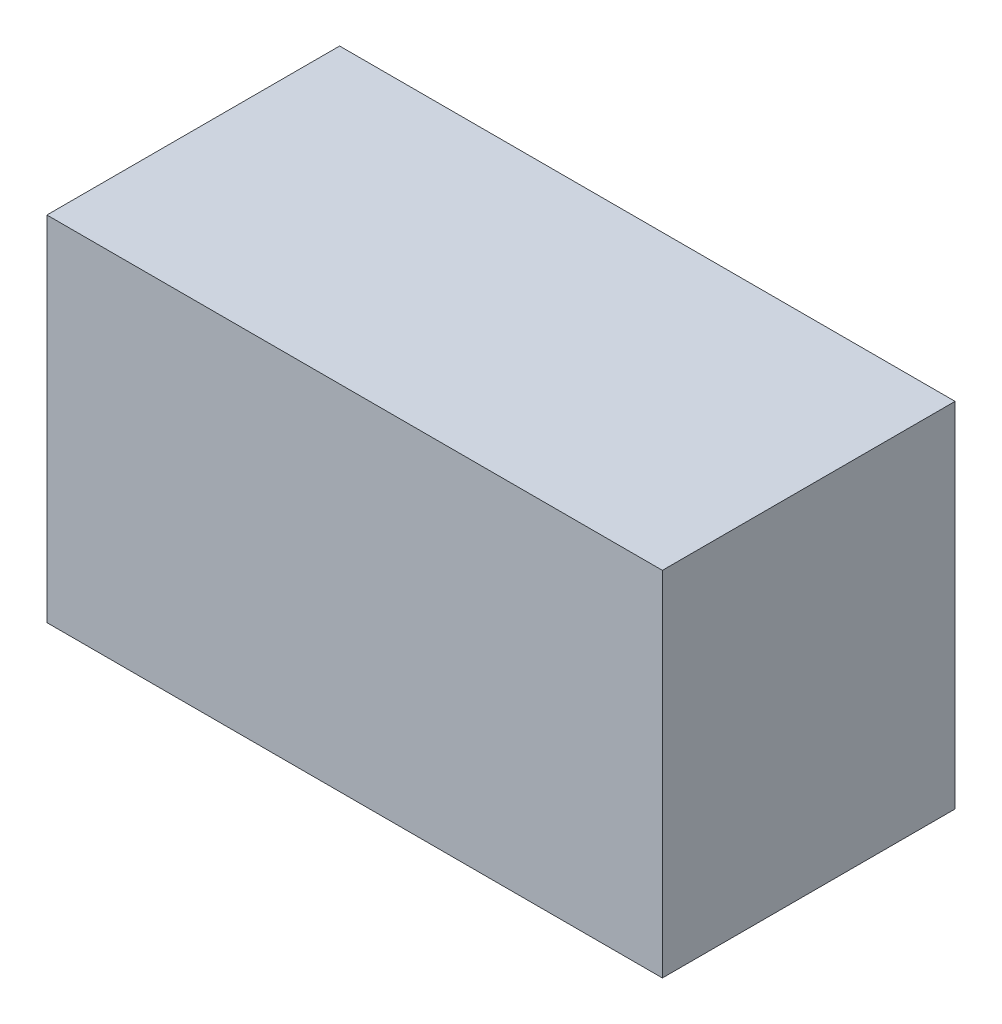
ISO-10303-21;
HEADER;
FILE_DESCRIPTION(('STEP AP214'),'2;1');
FILE_NAME('part.step','',(''),(''),'','','');
FILE_SCHEMA(('AUTOMOTIVE_DESIGN { 1 0 10303 214 1 1 1 1 }'));
ENDSEC;
DATA;
#1=APPLICATION_CONTEXT('core data for automotive mechanical design processes');
#2=APPLICATION_PROTOCOL_DEFINITION('international standard','automotive_design',2000,#1);
#3=PRODUCT_CONTEXT('',#1,'mechanical');
#4=PRODUCT('Part','Part','',(#3));
#5=PRODUCT_RELATED_PRODUCT_CATEGORY('part','',(#4));
#6=PRODUCT_DEFINITION_FORMATION('','',#4);
#7=PRODUCT_DEFINITION_CONTEXT('part definition',#1,'design');
#8=PRODUCT_DEFINITION('design','',#6,#7);
#9=PRODUCT_DEFINITION_SHAPE('','',#8);
#10=(LENGTH_UNIT() NAMED_UNIT(*) SI_UNIT(.MILLI.,.METRE.));
#11=(NAMED_UNIT(*) PLANE_ANGLE_UNIT() SI_UNIT($,.RADIAN.));
#12=(NAMED_UNIT(*) SI_UNIT($,.STERADIAN.) SOLID_ANGLE_UNIT());
#13=UNCERTAINTY_MEASURE_WITH_UNIT(LENGTH_MEASURE(1.E-05),#10,'distance_accuracy_value','');
#14=(GEOMETRIC_REPRESENTATION_CONTEXT(3) GLOBAL_UNCERTAINTY_ASSIGNED_CONTEXT((#13)) GLOBAL_UNIT_ASSIGNED_CONTEXT((#10,
#11,#12)) REPRESENTATION_CONTEXT('',''));
#15=CARTESIAN_POINT('',(0.,0.,0.));
#16=DIRECTION('',(0.,0.,1.));
#17=DIRECTION('',(1.,0.,0.));
#18=AXIS2_PLACEMENT_3D('',#15,#16,#17);
#19=CARTESIAN_POINT('',(-1.52449276,-0.87449152,1.44999964));
#20=DIRECTION('',(0.,0.,1.));
#21=DIRECTION('',(1.,0.,0.));
#22=AXIS2_PLACEMENT_3D('',#19,#20,#21);
#23=PLANE('',#22);
#24=DIRECTION('',(-1.,0.,0.));
#25=VECTOR('',#24,1.);
#26=CARTESIAN_POINT('',(1.52449276,-0.87449152,1.44999964));
#27=LINE('',#26,#25);
#28=CARTESIAN_POINT('',(1.52449276,-0.87449152,1.44999964));
#29=VERTEX_POINT('',#28);
#30=CARTESIAN_POINT('',(-1.52449276,-0.87449152,1.44999964));
#31=VERTEX_POINT('',#30);
#32=EDGE_CURVE('E25',#29,#31,#27,.T.);
#33=ORIENTED_EDGE('',*,*,#32,.F.);
#34=DIRECTION('',(0.,-1.,0.));
#35=VECTOR('',#34,1.);
#36=CARTESIAN_POINT('',(1.52449276,0.87449152,1.44999964));
#37=LINE('',#36,#35);
#38=CARTESIAN_POINT('',(1.52449276,0.87449152,1.44999964));
#39=VERTEX_POINT('',#38);
#40=EDGE_CURVE('E94',#39,#29,#37,.T.);
#41=ORIENTED_EDGE('',*,*,#40,.F.);
#42=DIRECTION('',(1.,0.,0.));
#43=VECTOR('',#42,1.);
#44=CARTESIAN_POINT('',(-1.52449276,0.87449152,1.44999964));
#45=LINE('',#44,#43);
#46=CARTESIAN_POINT('',(-1.52449276,0.87449152,1.44999964));
#47=VERTEX_POINT('',#46);
#48=EDGE_CURVE('E82',#47,#39,#45,.T.);
#49=ORIENTED_EDGE('',*,*,#48,.F.);
#50=DIRECTION('',(0.,1.,0.));
#51=VECTOR('',#50,1.);
#52=CARTESIAN_POINT('',(-1.52449276,-0.87449152,1.44999964));
#53=LINE('',#52,#51);
#54=EDGE_CURVE('E86',#31,#47,#53,.T.);
#55=ORIENTED_EDGE('',*,*,#54,.F.);
#56=EDGE_LOOP('',(#33,#41,#49,#55));
#57=FACE_BOUND('',#56,.T.);
#58=ADVANCED_FACE('F17',(#57),#23,.T.);
#59=CARTESIAN_POINT('',(-1.52449276,-0.87449152,0.));
#60=DIRECTION('',(0.,0.,1.));
#61=DIRECTION('',(1.,0.,0.));
#62=AXIS2_PLACEMENT_3D('',#59,#60,#61);
#63=PLANE('',#62);
#64=DIRECTION('',(0.,1.,0.));
#65=VECTOR('',#64,1.);
#66=CARTESIAN_POINT('',(-1.52449276,-0.87449152,0.));
#67=LINE('',#66,#65);
#68=CARTESIAN_POINT('',(-1.52449276,-0.87449152,0.));
#69=VERTEX_POINT('',#68);
#70=CARTESIAN_POINT('',(-1.52449276,0.87449152,0.));
#71=VERTEX_POINT('',#70);
#72=EDGE_CURVE('E70',#69,#71,#67,.T.);
#73=ORIENTED_EDGE('',*,*,#72,.T.);
#74=DIRECTION('',(1.,0.,0.));
#75=VECTOR('',#74,1.);
#76=CARTESIAN_POINT('',(-1.52449276,0.87449152,0.));
#77=LINE('',#76,#75);
#78=CARTESIAN_POINT('',(1.52449276,0.87449152,0.));
#79=VERTEX_POINT('',#78);
#80=EDGE_CURVE('E105',#71,#79,#77,.T.);
#81=ORIENTED_EDGE('',*,*,#80,.T.);
#82=DIRECTION('',(0.,-1.,0.));
#83=VECTOR('',#82,1.);
#84=CARTESIAN_POINT('',(1.52449276,0.87449152,0.));
#85=LINE('',#84,#83);
#86=CARTESIAN_POINT('',(1.52449276,-0.87449152,0.));
#87=VERTEX_POINT('',#86);
#88=EDGE_CURVE('E72',#79,#87,#85,.T.);
#89=ORIENTED_EDGE('',*,*,#88,.T.);
#90=DIRECTION('',(-1.,0.,0.));
#91=VECTOR('',#90,1.);
#92=CARTESIAN_POINT('',(1.52449276,-0.87449152,0.));
#93=LINE('',#92,#91);
#94=EDGE_CURVE('E11',#87,#69,#93,.T.);
#95=ORIENTED_EDGE('',*,*,#94,.T.);
#96=EDGE_LOOP('',(#73,#81,#89,#95));
#97=FACE_BOUND('',#96,.T.);
#98=ADVANCED_FACE('F68',(#97),#63,.F.);
#99=CARTESIAN_POINT('',(1.52449276,-0.87449152,0.));
#100=DIRECTION('',(0.,-1.,0.));
#101=DIRECTION('',(0.,0.,-1.));
#102=AXIS2_PLACEMENT_3D('',#99,#100,#101);
#103=PLANE('',#102);
#104=DIRECTION('',(0.,0.,1.));
#105=VECTOR('',#104,1.);
#106=CARTESIAN_POINT('',(1.52449276,-0.87449152,0.));
#107=LINE('',#106,#105);
#108=EDGE_CURVE('E110',#87,#29,#107,.T.);
#109=ORIENTED_EDGE('',*,*,#108,.T.);
#110=ORIENTED_EDGE('',*,*,#32,.T.);
#111=DIRECTION('',(0.,0.,1.));
#112=VECTOR('',#111,1.);
#113=CARTESIAN_POINT('',(-1.52449276,-0.87449152,0.));
#114=LINE('',#113,#112);
#115=EDGE_CURVE('E78',#69,#31,#114,.T.);
#116=ORIENTED_EDGE('',*,*,#115,.F.);
#117=ORIENTED_EDGE('',*,*,#94,.F.);
#118=EDGE_LOOP('',(#109,#110,#116,#117));
#119=FACE_BOUND('',#118,.T.);
#120=ADVANCED_FACE('F84',(#119),#103,.T.);
#121=CARTESIAN_POINT('',(1.52449276,0.87449152,0.));
#122=DIRECTION('',(1.,0.,0.));
#123=DIRECTION('',(0.,1.,0.));
#124=AXIS2_PLACEMENT_3D('',#121,#122,#123);
#125=PLANE('',#124);
#126=DIRECTION('',(0.,0.,1.));
#127=VECTOR('',#126,1.);
#128=CARTESIAN_POINT('',(1.52449276,0.87449152,0.));
#129=LINE('',#128,#127);
#130=EDGE_CURVE('E99',#79,#39,#129,.T.);
#131=ORIENTED_EDGE('',*,*,#130,.T.);
#132=ORIENTED_EDGE('',*,*,#40,.T.);
#133=ORIENTED_EDGE('',*,*,#108,.F.);
#134=ORIENTED_EDGE('',*,*,#88,.F.);
#135=EDGE_LOOP('',(#131,#132,#133,#134));
#136=FACE_BOUND('',#135,.T.);
#137=ADVANCED_FACE('F153',(#136),#125,.T.);
#138=CARTESIAN_POINT('',(-1.52449276,0.87449152,0.));
#139=DIRECTION('',(0.,1.,0.));
#140=DIRECTION('',(1.,0.,0.));
#141=AXIS2_PLACEMENT_3D('',#138,#139,#140);
#142=PLANE('',#141);
#143=DIRECTION('',(0.,0.,1.));
#144=VECTOR('',#143,1.);
#145=CARTESIAN_POINT('',(-1.52449276,0.87449152,0.));
#146=LINE('',#145,#144);
#147=EDGE_CURVE('E80',#71,#47,#146,.T.);
#148=ORIENTED_EDGE('',*,*,#147,.T.);
#149=ORIENTED_EDGE('',*,*,#48,.T.);
#150=ORIENTED_EDGE('',*,*,#130,.F.);
#151=ORIENTED_EDGE('',*,*,#80,.F.);
#152=EDGE_LOOP('',(#148,#149,#150,#151));
#153=FACE_BOUND('',#152,.T.);
#154=ADVANCED_FACE('F156',(#153),#142,.T.);
#155=CARTESIAN_POINT('',(-1.52449276,-0.87449152,0.));
#156=DIRECTION('',(-1.,0.,0.));
#157=DIRECTION('',(0.,0.,1.));
#158=AXIS2_PLACEMENT_3D('',#155,#156,#157);
#159=PLANE('',#158);
#160=ORIENTED_EDGE('',*,*,#115,.T.);
#161=ORIENTED_EDGE('',*,*,#54,.T.);
#162=ORIENTED_EDGE('',*,*,#147,.F.);
#163=ORIENTED_EDGE('',*,*,#72,.F.);
#164=EDGE_LOOP('',(#160,#161,#162,#163));
#165=FACE_BOUND('',#164,.T.);
#166=ADVANCED_FACE('F76',(#165),#159,.T.);
#167=CLOSED_SHELL('',(#58,#98,#120,#137,#154,#166));
#168=MANIFOLD_SOLID_BREP('B1',#167);
#169=ADVANCED_BREP_SHAPE_REPRESENTATION('',(#18,#168),#14);
#170=SHAPE_DEFINITION_REPRESENTATION(#9,#169);
ENDSEC;
END-ISO-10303-21;
